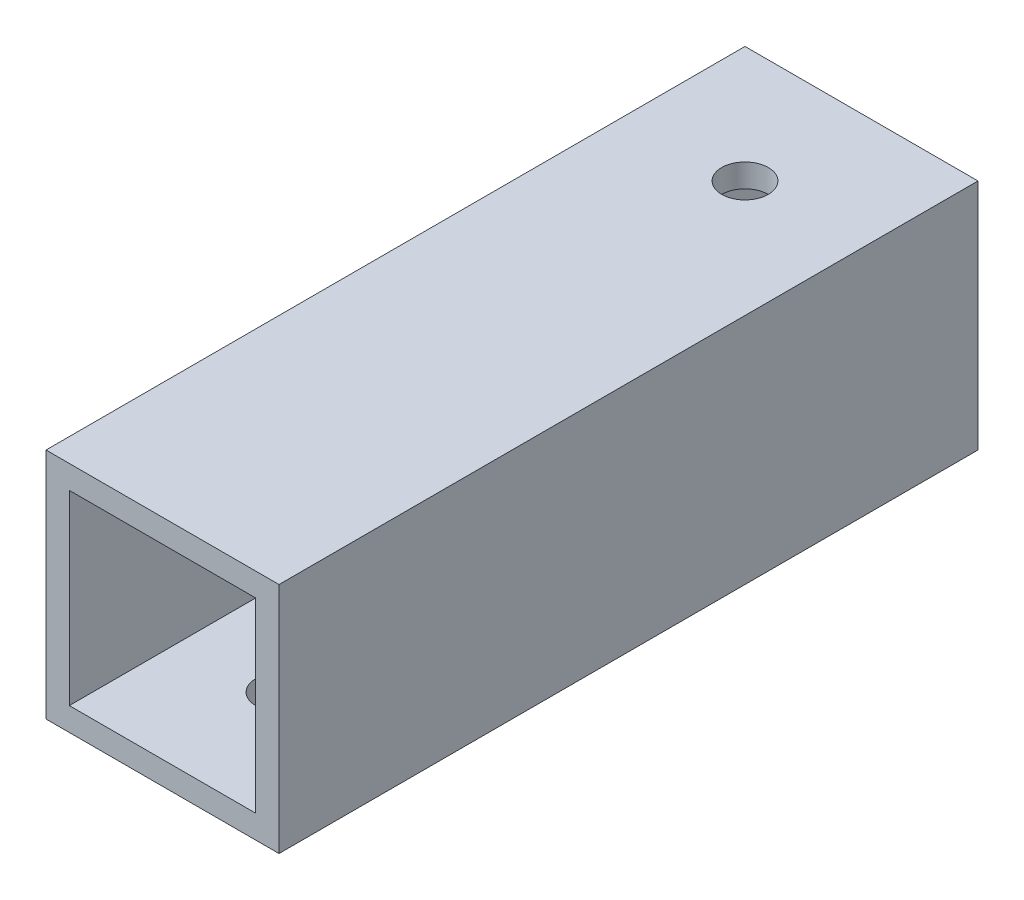
ISO-10303-21;
HEADER;
FILE_DESCRIPTION(('STEP AP214'),'2;1');
FILE_NAME('part.step','',(''),(''),'','','');
FILE_SCHEMA(('AUTOMOTIVE_DESIGN { 1 0 10303 214 1 1 1 1 }'));
ENDSEC;
DATA;
#1=APPLICATION_CONTEXT('core data for automotive mechanical design processes');
#2=APPLICATION_PROTOCOL_DEFINITION('international standard','automotive_design',2000,#1);
#3=PRODUCT_CONTEXT('',#1,'mechanical');
#4=PRODUCT('Part','Part','',(#3));
#5=PRODUCT_RELATED_PRODUCT_CATEGORY('part','',(#4));
#6=PRODUCT_DEFINITION_FORMATION('','',#4);
#7=PRODUCT_DEFINITION_CONTEXT('part definition',#1,'design');
#8=PRODUCT_DEFINITION('design','',#6,#7);
#9=PRODUCT_DEFINITION_SHAPE('','',#8);
#10=(LENGTH_UNIT() NAMED_UNIT(*) SI_UNIT(.MILLI.,.METRE.));
#11=(NAMED_UNIT(*) PLANE_ANGLE_UNIT() SI_UNIT($,.RADIAN.));
#12=(NAMED_UNIT(*) SI_UNIT($,.STERADIAN.) SOLID_ANGLE_UNIT());
#13=UNCERTAINTY_MEASURE_WITH_UNIT(LENGTH_MEASURE(1.E-05),#10,'distance_accuracy_value','');
#14=(GEOMETRIC_REPRESENTATION_CONTEXT(3) GLOBAL_UNCERTAINTY_ASSIGNED_CONTEXT((#13)) GLOBAL_UNIT_ASSIGNED_CONTEXT((#10,
#11,#12)) REPRESENTATION_CONTEXT('',''));
#15=CARTESIAN_POINT('',(0.,0.,0.));
#16=DIRECTION('',(0.,0.,1.));
#17=DIRECTION('',(1.,0.,0.));
#18=AXIS2_PLACEMENT_3D('',#15,#16,#17);
#19=CARTESIAN_POINT('',(0.,0.,45.));
#20=DIRECTION('',(0.,0.,1.));
#21=DIRECTION('',(1.,0.,0.));
#22=AXIS2_PLACEMENT_3D('',#19,#20,#21);
#23=PLANE('',#22);
#24=DIRECTION('',(0.,-1.,0.));
#25=VECTOR('',#24,1.);
#26=CARTESIAN_POINT('',(-7.01008414074451,7.73262608579252,45.));
#27=LINE('',#26,#25);
#28=CARTESIAN_POINT('',(-7.01008414074451,7.73262608579252,45.));
#29=VERTEX_POINT('',#28);
#30=CARTESIAN_POINT('',(-7.01008414074451,-7.26737391420748,45.));
#31=VERTEX_POINT('',#30);
#32=EDGE_CURVE('E138',#29,#31,#27,.T.);
#33=ORIENTED_EDGE('',*,*,#32,.T.);
#34=DIRECTION('',(1.,0.,0.));
#35=VECTOR('',#34,1.);
#36=CARTESIAN_POINT('',(-7.01008414074451,-7.26737391420748,45.));
#37=LINE('',#36,#35);
#38=CARTESIAN_POINT('',(7.98991585925548,-7.26737391420748,45.));
#39=VERTEX_POINT('',#38);
#40=EDGE_CURVE('E141',#31,#39,#37,.T.);
#41=ORIENTED_EDGE('',*,*,#40,.T.);
#42=DIRECTION('',(0.,1.,0.));
#43=VECTOR('',#42,1.);
#44=CARTESIAN_POINT('',(7.98991585925549,7.73262608579252,45.));
#45=LINE('',#44,#43);
#46=CARTESIAN_POINT('',(7.98991585925549,7.73262608579252,45.));
#47=VERTEX_POINT('',#46);
#48=EDGE_CURVE('E144',#39,#47,#45,.T.);
#49=ORIENTED_EDGE('',*,*,#48,.T.);
#50=DIRECTION('',(-1.,0.,0.));
#51=VECTOR('',#50,1.);
#52=CARTESIAN_POINT('',(-7.01008414074451,7.73262608579252,45.));
#53=LINE('',#52,#51);
#54=EDGE_CURVE('E146',#47,#29,#53,.T.);
#55=ORIENTED_EDGE('',*,*,#54,.T.);
#56=EDGE_LOOP('',(#33,#41,#49,#55));
#57=FACE_BOUND('',#56,.T.);
#58=DIRECTION('',(1.,0.,0.));
#59=VECTOR('',#58,1.);
#60=CARTESIAN_POINT('',(-5.51008414074451,-5.76737391420748,45.));
#61=LINE('',#60,#59);
#62=CARTESIAN_POINT('',(-5.51008414074451,-5.76737391420748,45.));
#63=VERTEX_POINT('',#62);
#64=CARTESIAN_POINT('',(6.48991585925549,-5.76737391420748,45.));
#65=VERTEX_POINT('',#64);
#66=EDGE_CURVE('E108',#63,#65,#61,.T.);
#67=ORIENTED_EDGE('',*,*,#66,.F.);
#68=DIRECTION('',(0.,-1.,0.));
#69=VECTOR('',#68,1.);
#70=CARTESIAN_POINT('',(-5.51008414074451,6.23262608579252,45.));
#71=LINE('',#70,#69);
#72=CARTESIAN_POINT('',(-5.51008414074451,6.23262608579252,45.));
#73=VERTEX_POINT('',#72);
#74=EDGE_CURVE('E100',#73,#63,#71,.T.);
#75=ORIENTED_EDGE('',*,*,#74,.F.);
#76=DIRECTION('',(-1.,0.,0.));
#77=VECTOR('',#76,1.);
#78=CARTESIAN_POINT('',(-5.51008414074451,6.23262608579252,45.));
#79=LINE('',#78,#77);
#80=CARTESIAN_POINT('',(6.48991585925549,6.23262608579252,45.));
#81=VERTEX_POINT('',#80);
#82=EDGE_CURVE('E122',#81,#73,#79,.T.);
#83=ORIENTED_EDGE('',*,*,#82,.F.);
#84=DIRECTION('',(0.,1.,0.));
#85=VECTOR('',#84,1.);
#86=CARTESIAN_POINT('',(6.48991585925549,6.23262608579252,45.));
#87=LINE('',#86,#85);
#88=EDGE_CURVE('E120',#65,#81,#87,.T.);
#89=ORIENTED_EDGE('',*,*,#88,.F.);
#90=EDGE_LOOP('',(#67,#75,#83,#89));
#91=FACE_BOUND('',#90,.T.);
#92=ADVANCED_FACE('F33',(#57,#91),#23,.T.);
#93=CARTESIAN_POINT('',(0.,0.,0.));
#94=DIRECTION('',(0.,0.,1.));
#95=DIRECTION('',(1.,0.,0.));
#96=AXIS2_PLACEMENT_3D('',#93,#94,#95);
#97=PLANE('',#96);
#98=DIRECTION('',(0.,-1.,0.));
#99=VECTOR('',#98,1.);
#100=CARTESIAN_POINT('',(-7.01008414074451,7.73262608579252,0.));
#101=LINE('',#100,#99);
#102=CARTESIAN_POINT('',(-7.01008414074451,7.73262608579252,0.));
#103=VERTEX_POINT('',#102);
#104=CARTESIAN_POINT('',(-7.01008414074451,-7.26737391420748,0.));
#105=VERTEX_POINT('',#104);
#106=EDGE_CURVE('E116',#103,#105,#101,.T.);
#107=ORIENTED_EDGE('',*,*,#106,.F.);
#108=DIRECTION('',(-1.,0.,0.));
#109=VECTOR('',#108,1.);
#110=CARTESIAN_POINT('',(-7.01008414074451,7.73262608579252,0.));
#111=LINE('',#110,#109);
#112=CARTESIAN_POINT('',(7.98991585925549,7.73262608579252,0.));
#113=VERTEX_POINT('',#112);
#114=EDGE_CURVE('E142',#113,#103,#111,.T.);
#115=ORIENTED_EDGE('',*,*,#114,.F.);
#116=DIRECTION('',(0.,1.,0.));
#117=VECTOR('',#116,1.);
#118=CARTESIAN_POINT('',(7.98991585925549,7.73262608579252,0.));
#119=LINE('',#118,#117);
#120=CARTESIAN_POINT('',(7.98991585925548,-7.26737391420748,0.));
#121=VERTEX_POINT('',#120);
#122=EDGE_CURVE('E153',#121,#113,#119,.T.);
#123=ORIENTED_EDGE('',*,*,#122,.F.);
#124=DIRECTION('',(1.,0.,0.));
#125=VECTOR('',#124,1.);
#126=CARTESIAN_POINT('',(-7.01008414074451,-7.26737391420748,0.));
#127=LINE('',#126,#125);
#128=EDGE_CURVE('E151',#105,#121,#127,.T.);
#129=ORIENTED_EDGE('',*,*,#128,.F.);
#130=EDGE_LOOP('',(#107,#115,#123,#129));
#131=FACE_BOUND('',#130,.T.);
#132=DIRECTION('',(0.,-1.,0.));
#133=VECTOR('',#132,1.);
#134=CARTESIAN_POINT('',(-5.51008414074451,6.23262608579252,0.));
#135=LINE('',#134,#133);
#136=CARTESIAN_POINT('',(-5.51008414074451,6.23262608579252,0.));
#137=VERTEX_POINT('',#136);
#138=CARTESIAN_POINT('',(-5.51008414074451,-5.76737391420748,0.));
#139=VERTEX_POINT('',#138);
#140=EDGE_CURVE('E58',#137,#139,#135,.T.);
#141=ORIENTED_EDGE('',*,*,#140,.T.);
#142=DIRECTION('',(1.,0.,0.));
#143=VECTOR('',#142,1.);
#144=CARTESIAN_POINT('',(-5.51008414074451,-5.76737391420748,0.));
#145=LINE('',#144,#143);
#146=CARTESIAN_POINT('',(6.48991585925549,-5.76737391420748,0.));
#147=VERTEX_POINT('',#146);
#148=EDGE_CURVE('E115',#139,#147,#145,.T.);
#149=ORIENTED_EDGE('',*,*,#148,.T.);
#150=DIRECTION('',(0.,1.,0.));
#151=VECTOR('',#150,1.);
#152=CARTESIAN_POINT('',(6.48991585925549,6.23262608579252,0.));
#153=LINE('',#152,#151);
#154=CARTESIAN_POINT('',(6.48991585925549,6.23262608579252,0.));
#155=VERTEX_POINT('',#154);
#156=EDGE_CURVE('E130',#147,#155,#153,.T.);
#157=ORIENTED_EDGE('',*,*,#156,.T.);
#158=DIRECTION('',(-1.,0.,0.));
#159=VECTOR('',#158,1.);
#160=CARTESIAN_POINT('',(-5.51008414074451,6.23262608579252,0.));
#161=LINE('',#160,#159);
#162=EDGE_CURVE('E109',#155,#137,#161,.T.);
#163=ORIENTED_EDGE('',*,*,#162,.T.);
#164=EDGE_LOOP('',(#141,#149,#157,#163));
#165=FACE_BOUND('',#164,.T.);
#166=ADVANCED_FACE('F204',(#131,#165),#97,.F.);
#167=CARTESIAN_POINT('',(-7.01008414074451,7.73262608579252,45.));
#168=DIRECTION('',(1.,0.,0.));
#169=DIRECTION('',(0.,1.,0.));
#170=AXIS2_PLACEMENT_3D('',#167,#168,#169);
#171=PLANE('',#170);
#172=CARTESIAN_POINT('',(-7.01008414074451,-2.96737391420748,25.6));
#173=DIRECTION('',(-1.,0.,0.));
#174=DIRECTION('',(0.,-1.,0.));
#175=AXIS2_PLACEMENT_3D('',#172,#173,#174);
#176=CIRCLE('',#175,0.999999999999998);
#177=CARTESIAN_POINT('',(-7.01008414074451,-3.96737391420748,25.6));
#178=VERTEX_POINT('',#177);
#179=EDGE_CURVE('E171',#178,#178,#176,.T.);
#180=ORIENTED_EDGE('',*,*,#179,.F.);
#181=EDGE_LOOP('',(#180));
#182=FACE_BOUND('',#181,.T.);
#183=CARTESIAN_POINT('',(-7.01008414074451,-2.96737391420748,14.8));
#184=DIRECTION('',(-1.,0.,0.));
#185=DIRECTION('',(0.,-1.,0.));
#186=AXIS2_PLACEMENT_3D('',#183,#184,#185);
#187=CIRCLE('',#186,1.);
#188=CARTESIAN_POINT('',(-7.01008414074451,-3.96737391420748,14.8));
#189=VERTEX_POINT('',#188);
#190=EDGE_CURVE('E176',#189,#189,#187,.T.);
#191=ORIENTED_EDGE('',*,*,#190,.F.);
#192=EDGE_LOOP('',(#191));
#193=FACE_BOUND('',#192,.T.);
#194=ORIENTED_EDGE('',*,*,#106,.T.);
#195=DIRECTION('',(0.,0.,-1.));
#196=VECTOR('',#195,1.);
#197=CARTESIAN_POINT('',(-7.01008414074451,-7.26737391420748,45.));
#198=LINE('',#197,#196);
#199=EDGE_CURVE('E11',#31,#105,#198,.T.);
#200=ORIENTED_EDGE('',*,*,#199,.F.);
#201=ORIENTED_EDGE('',*,*,#32,.F.);
#202=DIRECTION('',(0.,0.,-1.));
#203=VECTOR('',#202,1.);
#204=CARTESIAN_POINT('',(-7.01008414074451,7.73262608579252,45.));
#205=LINE('',#204,#203);
#206=EDGE_CURVE('E148',#29,#103,#205,.T.);
#207=ORIENTED_EDGE('',*,*,#206,.T.);
#208=EDGE_LOOP('',(#194,#200,#201,#207));
#209=FACE_BOUND('',#208,.T.);
#210=ADVANCED_FACE('F35',(#182,#193,#209),#171,.F.);
#211=CARTESIAN_POINT('',(-7.01008414074451,-7.26737391420748,45.));
#212=DIRECTION('',(0.,1.,0.));
#213=DIRECTION('',(0.,0.,1.));
#214=AXIS2_PLACEMENT_3D('',#211,#212,#213);
#215=PLANE('',#214);
#216=CARTESIAN_POINT('',(0.489915859255484,-7.26737391420748,37.5));
#217=DIRECTION('',(0.,-1.,0.));
#218=DIRECTION('',(0.,0.,-1.));
#219=AXIS2_PLACEMENT_3D('',#216,#217,#218);
#220=CIRCLE('',#219,1.5);
#221=CARTESIAN_POINT('',(0.489915859255484,-7.26737391420748,36.));
#222=VERTEX_POINT('',#221);
#223=EDGE_CURVE('E168',#222,#222,#220,.T.);
#224=ORIENTED_EDGE('',*,*,#223,.F.);
#225=EDGE_LOOP('',(#224));
#226=FACE_BOUND('',#225,.T.);
#227=ORIENTED_EDGE('',*,*,#128,.T.);
#228=DIRECTION('',(0.,0.,-1.));
#229=VECTOR('',#228,1.);
#230=CARTESIAN_POINT('',(7.98991585925548,-7.26737391420748,45.));
#231=LINE('',#230,#229);
#232=EDGE_CURVE('E42',#39,#121,#231,.T.);
#233=ORIENTED_EDGE('',*,*,#232,.F.);
#234=ORIENTED_EDGE('',*,*,#40,.F.);
#235=ORIENTED_EDGE('',*,*,#199,.T.);
#236=EDGE_LOOP('',(#227,#233,#234,#235));
#237=FACE_BOUND('',#236,.T.);
#238=ADVANCED_FACE('F208',(#226,#237),#215,.F.);
#239=CARTESIAN_POINT('',(7.98991585925549,7.73262608579252,45.));
#240=DIRECTION('',(-1.,0.,0.));
#241=DIRECTION('',(0.,-1.,0.));
#242=AXIS2_PLACEMENT_3D('',#239,#240,#241);
#243=PLANE('',#242);
#244=ORIENTED_EDGE('',*,*,#122,.T.);
#245=DIRECTION('',(0.,0.,-1.));
#246=VECTOR('',#245,1.);
#247=CARTESIAN_POINT('',(7.98991585925549,7.73262608579252,45.));
#248=LINE('',#247,#246);
#249=EDGE_CURVE('E158',#47,#113,#248,.T.);
#250=ORIENTED_EDGE('',*,*,#249,.F.);
#251=ORIENTED_EDGE('',*,*,#48,.F.);
#252=ORIENTED_EDGE('',*,*,#232,.T.);
#253=EDGE_LOOP('',(#244,#250,#251,#252));
#254=FACE_BOUND('',#253,.T.);
#255=ADVANCED_FACE('F192',(#254),#243,.F.);
#256=CARTESIAN_POINT('',(-7.01008414074451,7.73262608579252,45.));
#257=DIRECTION('',(0.,-1.,0.));
#258=DIRECTION('',(0.,0.,-1.));
#259=AXIS2_PLACEMENT_3D('',#256,#257,#258);
#260=PLANE('',#259);
#261=CARTESIAN_POINT('',(0.489915859255487,7.73262608579252,7.5));
#262=DIRECTION('',(0.,1.,0.));
#263=DIRECTION('',(0.,0.,1.));
#264=AXIS2_PLACEMENT_3D('',#261,#262,#263);
#265=CIRCLE('',#264,1.5);
#266=CARTESIAN_POINT('',(0.489915859255487,7.73262608579252,9.));
#267=VERTEX_POINT('',#266);
#268=EDGE_CURVE('E165',#267,#267,#265,.T.);
#269=ORIENTED_EDGE('',*,*,#268,.F.);
#270=EDGE_LOOP('',(#269));
#271=FACE_BOUND('',#270,.T.);
#272=ORIENTED_EDGE('',*,*,#114,.T.);
#273=ORIENTED_EDGE('',*,*,#206,.F.);
#274=ORIENTED_EDGE('',*,*,#54,.F.);
#275=ORIENTED_EDGE('',*,*,#249,.T.);
#276=EDGE_LOOP('',(#272,#273,#274,#275));
#277=FACE_BOUND('',#276,.T.);
#278=ADVANCED_FACE('F189',(#271,#277),#260,.F.);
#279=CARTESIAN_POINT('',(-5.51008414074451,6.23262608579252,45.));
#280=DIRECTION('',(1.,0.,0.));
#281=DIRECTION('',(0.,1.,0.));
#282=AXIS2_PLACEMENT_3D('',#279,#280,#281);
#283=PLANE('',#282);
#284=CARTESIAN_POINT('',(-5.51008414074451,-2.96737391420748,25.6));
#285=DIRECTION('',(1.,0.,0.));
#286=DIRECTION('',(0.,1.,0.));
#287=AXIS2_PLACEMENT_3D('',#284,#285,#286);
#288=CIRCLE('',#287,0.999999999999998);
#289=CARTESIAN_POINT('',(-5.51008414074451,-1.96737391420748,25.6));
#290=VERTEX_POINT('',#289);
#291=EDGE_CURVE('E37',#290,#290,#288,.T.);
#292=ORIENTED_EDGE('',*,*,#291,.F.);
#293=EDGE_LOOP('',(#292));
#294=FACE_BOUND('',#293,.T.);
#295=CARTESIAN_POINT('',(-5.51008414074451,-2.96737391420748,14.8));
#296=DIRECTION('',(1.,0.,0.));
#297=DIRECTION('',(0.,1.,0.));
#298=AXIS2_PLACEMENT_3D('',#295,#296,#297);
#299=CIRCLE('',#298,1.);
#300=CARTESIAN_POINT('',(-5.51008414074451,-1.96737391420748,14.8));
#301=VERTEX_POINT('',#300);
#302=EDGE_CURVE('E169',#301,#301,#299,.T.);
#303=ORIENTED_EDGE('',*,*,#302,.F.);
#304=EDGE_LOOP('',(#303));
#305=FACE_BOUND('',#304,.T.);
#306=ORIENTED_EDGE('',*,*,#140,.F.);
#307=DIRECTION('',(0.,0.,-1.));
#308=VECTOR('',#307,1.);
#309=CARTESIAN_POINT('',(-5.51008414074451,6.23262608579252,45.));
#310=LINE('',#309,#308);
#311=EDGE_CURVE('E104',#73,#137,#310,.T.);
#312=ORIENTED_EDGE('',*,*,#311,.F.);
#313=ORIENTED_EDGE('',*,*,#74,.T.);
#314=DIRECTION('',(0.,0.,-1.));
#315=VECTOR('',#314,1.);
#316=CARTESIAN_POINT('',(-5.51008414074451,-5.76737391420748,45.));
#317=LINE('',#316,#315);
#318=EDGE_CURVE('E103',#63,#139,#317,.T.);
#319=ORIENTED_EDGE('',*,*,#318,.T.);
#320=EDGE_LOOP('',(#306,#312,#313,#319));
#321=FACE_BOUND('',#320,.T.);
#322=ADVANCED_FACE('F102',(#294,#305,#321),#283,.T.);
#323=CARTESIAN_POINT('',(-5.51008414074451,-5.76737391420748,45.));
#324=DIRECTION('',(0.,1.,0.));
#325=DIRECTION('',(0.,0.,1.));
#326=AXIS2_PLACEMENT_3D('',#323,#324,#325);
#327=PLANE('',#326);
#328=CARTESIAN_POINT('',(0.489915859255484,-5.76737391420748,37.5));
#329=DIRECTION('',(0.,1.,0.));
#330=DIRECTION('',(0.,0.,1.));
#331=AXIS2_PLACEMENT_3D('',#328,#329,#330);
#332=CIRCLE('',#331,1.5);
#333=CARTESIAN_POINT('',(0.489915859255484,-5.76737391420748,39.));
#334=VERTEX_POINT('',#333);
#335=EDGE_CURVE('E166',#334,#334,#332,.T.);
#336=ORIENTED_EDGE('',*,*,#335,.F.);
#337=EDGE_LOOP('',(#336));
#338=FACE_BOUND('',#337,.T.);
#339=ORIENTED_EDGE('',*,*,#148,.F.);
#340=ORIENTED_EDGE('',*,*,#318,.F.);
#341=ORIENTED_EDGE('',*,*,#66,.T.);
#342=DIRECTION('',(0.,0.,-1.));
#343=VECTOR('',#342,1.);
#344=CARTESIAN_POINT('',(6.48991585925549,-5.76737391420748,45.));
#345=LINE('',#344,#343);
#346=EDGE_CURVE('E117',#65,#147,#345,.T.);
#347=ORIENTED_EDGE('',*,*,#346,.T.);
#348=EDGE_LOOP('',(#339,#340,#341,#347));
#349=FACE_BOUND('',#348,.T.);
#350=ADVANCED_FACE('F112',(#338,#349),#327,.T.);
#351=CARTESIAN_POINT('',(6.48991585925549,6.23262608579252,45.));
#352=DIRECTION('',(-1.,0.,0.));
#353=DIRECTION('',(0.,-1.,0.));
#354=AXIS2_PLACEMENT_3D('',#351,#352,#353);
#355=PLANE('',#354);
#356=ORIENTED_EDGE('',*,*,#156,.F.);
#357=ORIENTED_EDGE('',*,*,#346,.F.);
#358=ORIENTED_EDGE('',*,*,#88,.T.);
#359=DIRECTION('',(0.,0.,-1.));
#360=VECTOR('',#359,1.);
#361=CARTESIAN_POINT('',(6.48991585925549,6.23262608579252,45.));
#362=LINE('',#361,#360);
#363=EDGE_CURVE('E50',#81,#155,#362,.T.);
#364=ORIENTED_EDGE('',*,*,#363,.T.);
#365=EDGE_LOOP('',(#356,#357,#358,#364));
#366=FACE_BOUND('',#365,.T.);
#367=ADVANCED_FACE('F230',(#366),#355,.T.);
#368=CARTESIAN_POINT('',(-5.51008414074451,6.23262608579252,45.));
#369=DIRECTION('',(0.,-1.,0.));
#370=DIRECTION('',(0.,0.,-1.));
#371=AXIS2_PLACEMENT_3D('',#368,#369,#370);
#372=PLANE('',#371);
#373=CARTESIAN_POINT('',(0.489915859255487,6.23262608579252,7.5));
#374=DIRECTION('',(0.,-1.,0.));
#375=DIRECTION('',(0.,0.,-1.));
#376=AXIS2_PLACEMENT_3D('',#373,#374,#375);
#377=CIRCLE('',#376,1.5);
#378=CARTESIAN_POINT('',(0.489915859255487,6.23262608579252,6.));
#379=VERTEX_POINT('',#378);
#380=EDGE_CURVE('E128',#379,#379,#377,.T.);
#381=ORIENTED_EDGE('',*,*,#380,.F.);
#382=EDGE_LOOP('',(#381));
#383=FACE_BOUND('',#382,.T.);
#384=ORIENTED_EDGE('',*,*,#162,.F.);
#385=ORIENTED_EDGE('',*,*,#363,.F.);
#386=ORIENTED_EDGE('',*,*,#82,.T.);
#387=ORIENTED_EDGE('',*,*,#311,.T.);
#388=EDGE_LOOP('',(#384,#385,#386,#387));
#389=FACE_BOUND('',#388,.T.);
#390=ADVANCED_FACE('F234',(#383,#389),#372,.T.);
#391=CARTESIAN_POINT('',(0.489915859255487,-2.26737391420748,7.5));
#392=DIRECTION('',(0.,1.,0.));
#393=DIRECTION('',(0.,0.,1.));
#394=AXIS2_PLACEMENT_3D('',#391,#392,#393);
#395=CYLINDRICAL_SURFACE('',#394,1.5);
#396=ORIENTED_EDGE('',*,*,#380,.T.);
#397=EDGE_LOOP('',(#396));
#398=FACE_BOUND('',#397,.T.);
#399=ORIENTED_EDGE('',*,*,#268,.T.);
#400=EDGE_LOOP('',(#399));
#401=FACE_BOUND('',#400,.T.);
#402=ADVANCED_FACE('F187',(#398,#401),#395,.F.);
#403=CARTESIAN_POINT('',(0.489915859255484,2.73262608579252,37.5));
#404=DIRECTION('',(0.,-1.,0.));
#405=DIRECTION('',(0.,0.,-1.));
#406=AXIS2_PLACEMENT_3D('',#403,#404,#405);
#407=CYLINDRICAL_SURFACE('',#406,1.5);
#408=ORIENTED_EDGE('',*,*,#335,.T.);
#409=EDGE_LOOP('',(#408));
#410=FACE_BOUND('',#409,.T.);
#411=ORIENTED_EDGE('',*,*,#223,.T.);
#412=EDGE_LOOP('',(#411));
#413=FACE_BOUND('',#412,.T.);
#414=ADVANCED_FACE('F241',(#410,#413),#407,.F.);
#415=CARTESIAN_POINT('',(2.98991585925549,-2.96737391420748,14.8));
#416=DIRECTION('',(-1.,0.,0.));
#417=DIRECTION('',(0.,-1.,0.));
#418=AXIS2_PLACEMENT_3D('',#415,#416,#417);
#419=CYLINDRICAL_SURFACE('',#418,1.);
#420=ORIENTED_EDGE('',*,*,#302,.T.);
#421=EDGE_LOOP('',(#420));
#422=FACE_BOUND('',#421,.T.);
#423=ORIENTED_EDGE('',*,*,#190,.T.);
#424=EDGE_LOOP('',(#423));
#425=FACE_BOUND('',#424,.T.);
#426=ADVANCED_FACE('F245',(#422,#425),#419,.F.);
#427=CARTESIAN_POINT('',(2.98991585925549,-2.96737391420748,25.6));
#428=DIRECTION('',(-1.,0.,0.));
#429=DIRECTION('',(0.,-1.,0.));
#430=AXIS2_PLACEMENT_3D('',#427,#428,#429);
#431=CYLINDRICAL_SURFACE('',#430,0.999999999999998);
#432=ORIENTED_EDGE('',*,*,#291,.T.);
#433=EDGE_LOOP('',(#432));
#434=FACE_BOUND('',#433,.T.);
#435=ORIENTED_EDGE('',*,*,#179,.T.);
#436=EDGE_LOOP('',(#435));
#437=FACE_BOUND('',#436,.T.);
#438=ADVANCED_FACE('F249',(#434,#437),#431,.F.);
#439=CLOSED_SHELL('',(#92,#166,#210,#238,#255,#278,#322,#350,#367,#390,#402,#414,#426,#438));
#440=MANIFOLD_SOLID_BREP('B2',#439);
#441=ADVANCED_BREP_SHAPE_REPRESENTATION('',(#18,#440),#14);
#442=SHAPE_DEFINITION_REPRESENTATION(#9,#441);
ENDSEC;
END-ISO-10303-21;
